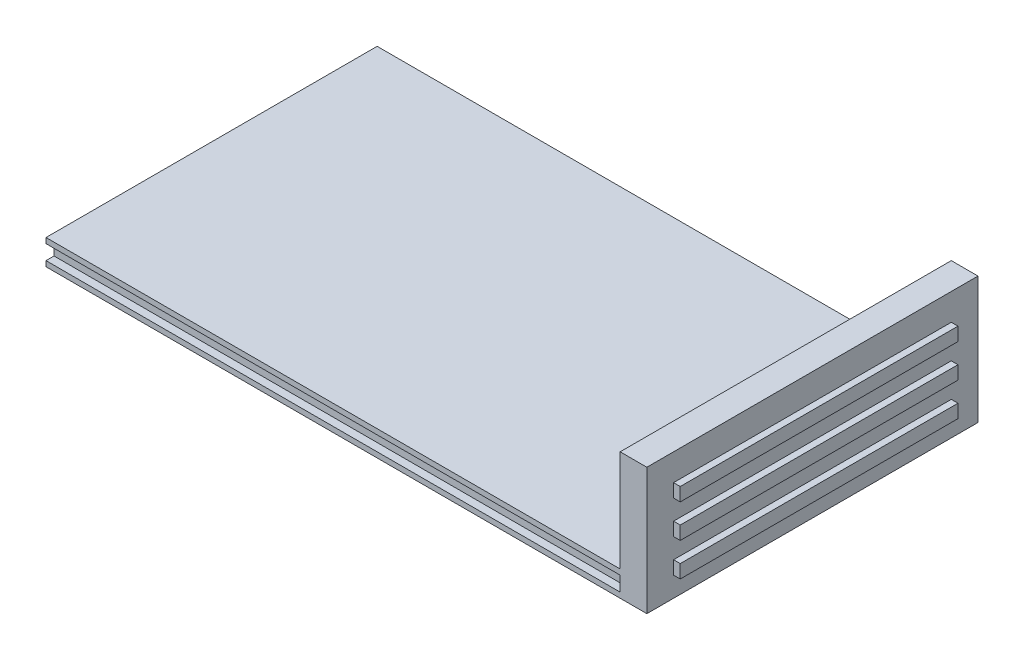
ISO-10303-21;
HEADER;
FILE_DESCRIPTION(('STEP AP214'),'2;1');
FILE_NAME('part.step','',(''),(''),'','','');
FILE_SCHEMA(('AUTOMOTIVE_DESIGN { 1 0 10303 214 1 1 1 1 }'));
ENDSEC;
DATA;
#1=APPLICATION_CONTEXT('core data for automotive mechanical design processes');
#2=APPLICATION_PROTOCOL_DEFINITION('international standard','automotive_design',2000,#1);
#3=PRODUCT_CONTEXT('',#1,'mechanical');
#4=PRODUCT('Part','Part','',(#3));
#5=PRODUCT_RELATED_PRODUCT_CATEGORY('part','',(#4));
#6=PRODUCT_DEFINITION_FORMATION('','',#4);
#7=PRODUCT_DEFINITION_CONTEXT('part definition',#1,'design');
#8=PRODUCT_DEFINITION('design','',#6,#7);
#9=PRODUCT_DEFINITION_SHAPE('','',#8);
#10=(LENGTH_UNIT() NAMED_UNIT(*) SI_UNIT(.MILLI.,.METRE.));
#11=(NAMED_UNIT(*) PLANE_ANGLE_UNIT() SI_UNIT($,.RADIAN.));
#12=(NAMED_UNIT(*) SI_UNIT($,.STERADIAN.) SOLID_ANGLE_UNIT());
#13=UNCERTAINTY_MEASURE_WITH_UNIT(LENGTH_MEASURE(1.E-05),#10,'distance_accuracy_value','');
#14=(GEOMETRIC_REPRESENTATION_CONTEXT(3) GLOBAL_UNCERTAINTY_ASSIGNED_CONTEXT((#13)) GLOBAL_UNIT_ASSIGNED_CONTEXT((#10,
#11,#12)) REPRESENTATION_CONTEXT('',''));
#15=CARTESIAN_POINT('',(0.,0.,0.));
#16=DIRECTION('',(0.,0.,1.));
#17=DIRECTION('',(1.,0.,0.));
#18=AXIS2_PLACEMENT_3D('',#15,#16,#17);
#19=CARTESIAN_POINT('',(46.,-10.,0.));
#20=DIRECTION('',(1.,0.,0.));
#21=DIRECTION('',(0.,0.,-1.));
#22=AXIS2_PLACEMENT_3D('',#19,#20,#21);
#23=PLANE('',#22);
#24=DIRECTION('',(0.,-1.,0.));
#25=VECTOR('',#24,1.);
#26=CARTESIAN_POINT('',(46.,5.,20.8));
#27=LINE('',#26,#25);
#28=CARTESIAN_POINT('',(46.,5.,20.8));
#29=VERTEX_POINT('',#28);
#30=CARTESIAN_POINT('',(46.,3.,20.8));
#31=VERTEX_POINT('',#30);
#32=EDGE_CURVE('E456',#29,#31,#27,.T.);
#33=ORIENTED_EDGE('',*,*,#32,.T.);
#34=DIRECTION('',(0.,0.,-1.));
#35=VECTOR('',#34,1.);
#36=CARTESIAN_POINT('',(46.,3.,20.8));
#37=LINE('',#36,#35);
#38=CARTESIAN_POINT('',(46.,3.,-20.8));
#39=VERTEX_POINT('',#38);
#40=EDGE_CURVE('E466',#31,#39,#37,.T.);
#41=ORIENTED_EDGE('',*,*,#40,.T.);
#42=DIRECTION('',(0.,1.,0.));
#43=VECTOR('',#42,1.);
#44=CARTESIAN_POINT('',(46.,5.,-20.8));
#45=LINE('',#44,#43);
#46=CARTESIAN_POINT('',(46.,5.,-20.8));
#47=VERTEX_POINT('',#46);
#48=EDGE_CURVE('E47',#39,#47,#45,.T.);
#49=ORIENTED_EDGE('',*,*,#48,.T.);
#50=DIRECTION('',(0.,0.,1.));
#51=VECTOR('',#50,1.);
#52=CARTESIAN_POINT('',(46.,5.,20.8));
#53=LINE('',#52,#51);
#54=EDGE_CURVE('E11',#47,#29,#53,.T.);
#55=ORIENTED_EDGE('',*,*,#54,.T.);
#56=EDGE_LOOP('',(#33,#41,#49,#55));
#57=FACE_BOUND('',#56,.T.);
#58=ADVANCED_FACE('F39',(#57),#23,.T.);
#59=CARTESIAN_POINT('',(46.,5.,20.8));
#60=DIRECTION('',(0.,-1.,0.));
#61=DIRECTION('',(0.,0.,-1.));
#62=AXIS2_PLACEMENT_3D('',#59,#60,#61);
#63=PLANE('',#62);
#64=DIRECTION('',(0.,0.,1.));
#65=VECTOR('',#64,1.);
#66=CARTESIAN_POINT('',(45.,5.,20.8));
#67=LINE('',#66,#65);
#68=CARTESIAN_POINT('',(45.,5.,-20.8));
#69=VERTEX_POINT('',#68);
#70=CARTESIAN_POINT('',(45.,5.,20.8));
#71=VERTEX_POINT('',#70);
#72=EDGE_CURVE('E442',#69,#71,#67,.T.);
#73=ORIENTED_EDGE('',*,*,#72,.T.);
#74=DIRECTION('',(-1.,0.,0.));
#75=VECTOR('',#74,1.);
#76=CARTESIAN_POINT('',(46.,5.,20.8));
#77=LINE('',#76,#75);
#78=EDGE_CURVE('E460',#29,#71,#77,.T.);
#79=ORIENTED_EDGE('',*,*,#78,.F.);
#80=ORIENTED_EDGE('',*,*,#54,.F.);
#81=DIRECTION('',(-1.,0.,0.));
#82=VECTOR('',#81,1.);
#83=CARTESIAN_POINT('',(46.,5.,-20.8));
#84=LINE('',#83,#82);
#85=EDGE_CURVE('E54',#47,#69,#84,.T.);
#86=ORIENTED_EDGE('',*,*,#85,.T.);
#87=EDGE_LOOP('',(#73,#79,#80,#86));
#88=FACE_BOUND('',#87,.T.);
#89=ADVANCED_FACE('F475',(#88),#63,.F.);
#90=CARTESIAN_POINT('',(46.,5.,-20.8));
#91=DIRECTION('',(0.,0.,1.));
#92=DIRECTION('',(1.,0.,0.));
#93=AXIS2_PLACEMENT_3D('',#90,#91,#92);
#94=PLANE('',#93);
#95=DIRECTION('',(0.,1.,0.));
#96=VECTOR('',#95,1.);
#97=CARTESIAN_POINT('',(45.,5.,-20.8));
#98=LINE('',#97,#96);
#99=CARTESIAN_POINT('',(45.,3.,-20.8));
#100=VERTEX_POINT('',#99);
#101=EDGE_CURVE('E446',#100,#69,#98,.T.);
#102=ORIENTED_EDGE('',*,*,#101,.T.);
#103=ORIENTED_EDGE('',*,*,#85,.F.);
#104=ORIENTED_EDGE('',*,*,#48,.F.);
#105=DIRECTION('',(-1.,0.,0.));
#106=VECTOR('',#105,1.);
#107=CARTESIAN_POINT('',(46.,3.,-20.8));
#108=LINE('',#107,#106);
#109=EDGE_CURVE('E62',#39,#100,#108,.T.);
#110=ORIENTED_EDGE('',*,*,#109,.T.);
#111=EDGE_LOOP('',(#102,#103,#104,#110));
#112=FACE_BOUND('',#111,.T.);
#113=ADVANCED_FACE('F481',(#112),#94,.F.);
#114=CARTESIAN_POINT('',(46.,3.,20.8));
#115=DIRECTION('',(0.,1.,0.));
#116=DIRECTION('',(0.,0.,1.));
#117=AXIS2_PLACEMENT_3D('',#114,#115,#116);
#118=PLANE('',#117);
#119=DIRECTION('',(0.,0.,-1.));
#120=VECTOR('',#119,1.);
#121=CARTESIAN_POINT('',(45.,3.,20.8));
#122=LINE('',#121,#120);
#123=CARTESIAN_POINT('',(45.,3.,20.8));
#124=VERTEX_POINT('',#123);
#125=EDGE_CURVE('E449',#124,#100,#122,.T.);
#126=ORIENTED_EDGE('',*,*,#125,.T.);
#127=ORIENTED_EDGE('',*,*,#109,.F.);
#128=ORIENTED_EDGE('',*,*,#40,.F.);
#129=DIRECTION('',(-1.,0.,0.));
#130=VECTOR('',#129,1.);
#131=CARTESIAN_POINT('',(46.,3.,20.8));
#132=LINE('',#131,#130);
#133=EDGE_CURVE('E452',#31,#124,#132,.T.);
#134=ORIENTED_EDGE('',*,*,#133,.T.);
#135=EDGE_LOOP('',(#126,#127,#128,#134));
#136=FACE_BOUND('',#135,.T.);
#137=ADVANCED_FACE('F479',(#136),#118,.F.);
#138=CARTESIAN_POINT('',(46.,5.,20.8));
#139=DIRECTION('',(0.,0.,-1.));
#140=DIRECTION('',(0.,1.,0.));
#141=AXIS2_PLACEMENT_3D('',#138,#139,#140);
#142=PLANE('',#141);
#143=DIRECTION('',(0.,-1.,0.));
#144=VECTOR('',#143,1.);
#145=CARTESIAN_POINT('',(45.,5.,20.8));
#146=LINE('',#145,#144);
#147=EDGE_CURVE('E439',#71,#124,#146,.T.);
#148=ORIENTED_EDGE('',*,*,#147,.T.);
#149=ORIENTED_EDGE('',*,*,#133,.F.);
#150=ORIENTED_EDGE('',*,*,#32,.F.);
#151=ORIENTED_EDGE('',*,*,#78,.T.);
#152=EDGE_LOOP('',(#148,#149,#150,#151));
#153=FACE_BOUND('',#152,.T.);
#154=ADVANCED_FACE('F477',(#153),#142,.F.);
#155=CARTESIAN_POINT('',(45.,3.8,24.8));
#156=DIRECTION('',(-1.,0.,0.));
#157=DIRECTION('',(0.,0.,1.));
#158=AXIS2_PLACEMENT_3D('',#155,#156,#157);
#159=PLANE('',#158);
#160=DIRECTION('',(0.,-1.,0.));
#161=VECTOR('',#160,1.);
#162=CARTESIAN_POINT('',(45.,15.,20.8));
#163=LINE('',#162,#161);
#164=CARTESIAN_POINT('',(45.,15.,20.8));
#165=VERTEX_POINT('',#164);
#166=CARTESIAN_POINT('',(45.,13.,20.8));
#167=VERTEX_POINT('',#166);
#168=EDGE_CURVE('E248',#165,#167,#163,.T.);
#169=ORIENTED_EDGE('',*,*,#168,.F.);
#170=DIRECTION('',(0.,0.,1.));
#171=VECTOR('',#170,1.);
#172=CARTESIAN_POINT('',(45.,15.,20.8));
#173=LINE('',#172,#171);
#174=CARTESIAN_POINT('',(45.,15.,-20.8));
#175=VERTEX_POINT('',#174);
#176=EDGE_CURVE('E258',#175,#165,#173,.T.);
#177=ORIENTED_EDGE('',*,*,#176,.F.);
#178=DIRECTION('',(0.,1.,0.));
#179=VECTOR('',#178,1.);
#180=CARTESIAN_POINT('',(45.,15.,-20.8));
#181=LINE('',#180,#179);
#182=CARTESIAN_POINT('',(45.,13.,-20.8));
#183=VERTEX_POINT('',#182);
#184=EDGE_CURVE('E275',#183,#175,#181,.T.);
#185=ORIENTED_EDGE('',*,*,#184,.F.);
#186=DIRECTION('',(0.,0.,-1.));
#187=VECTOR('',#186,1.);
#188=CARTESIAN_POINT('',(45.,13.,20.8));
#189=LINE('',#188,#187);
#190=EDGE_CURVE('E271',#167,#183,#189,.T.);
#191=ORIENTED_EDGE('',*,*,#190,.F.);
#192=EDGE_LOOP('',(#169,#177,#185,#191));
#193=FACE_BOUND('',#192,.T.);
#194=DIRECTION('',(0.,-1.,0.));
#195=VECTOR('',#194,1.);
#196=CARTESIAN_POINT('',(45.,3.8,24.8));
#197=LINE('',#196,#195);
#198=CARTESIAN_POINT('',(45.,19.,24.8));
#199=VERTEX_POINT('',#198);
#200=CARTESIAN_POINT('',(45.,0.,24.8));
#201=VERTEX_POINT('',#200);
#202=EDGE_CURVE('E406',#199,#201,#197,.T.);
#203=ORIENTED_EDGE('',*,*,#202,.T.);
#204=DIRECTION('',(0.,0.,-1.));
#205=VECTOR('',#204,1.);
#206=CARTESIAN_POINT('',(45.,0.,24.8));
#207=LINE('',#206,#205);
#208=CARTESIAN_POINT('',(45.,0.,-24.8));
#209=VERTEX_POINT('',#208);
#210=EDGE_CURVE('E385',#201,#209,#207,.T.);
#211=ORIENTED_EDGE('',*,*,#210,.T.);
#212=DIRECTION('',(0.,-1.,0.));
#213=VECTOR('',#212,1.);
#214=CARTESIAN_POINT('',(45.,3.8,-24.8));
#215=LINE('',#214,#213);
#216=CARTESIAN_POINT('',(45.,19.,-24.8));
#217=VERTEX_POINT('',#216);
#218=EDGE_CURVE('E432',#217,#209,#215,.T.);
#219=ORIENTED_EDGE('',*,*,#218,.F.);
#220=DIRECTION('',(0.,0.,1.));
#221=VECTOR('',#220,1.);
#222=CARTESIAN_POINT('',(45.,19.,24.8));
#223=LINE('',#222,#221);
#224=EDGE_CURVE('E297',#217,#199,#223,.T.);
#225=ORIENTED_EDGE('',*,*,#224,.T.);
#226=EDGE_LOOP('',(#203,#211,#219,#225));
#227=FACE_BOUND('',#226,.T.);
#228=DIRECTION('',(0.,-1.,0.));
#229=VECTOR('',#228,1.);
#230=CARTESIAN_POINT('',(45.,10.,20.8));
#231=LINE('',#230,#229);
#232=CARTESIAN_POINT('',(45.,10.,20.8));
#233=VERTEX_POINT('',#232);
#234=CARTESIAN_POINT('',(45.,8.,20.8));
#235=VERTEX_POINT('',#234);
#236=EDGE_CURVE('E242',#233,#235,#231,.T.);
#237=ORIENTED_EDGE('',*,*,#236,.F.);
#238=DIRECTION('',(0.,0.,1.));
#239=VECTOR('',#238,1.);
#240=CARTESIAN_POINT('',(45.,10.,20.8));
#241=LINE('',#240,#239);
#242=CARTESIAN_POINT('',(45.,10.,-20.8));
#243=VERTEX_POINT('',#242);
#244=EDGE_CURVE('E227',#243,#233,#241,.T.);
#245=ORIENTED_EDGE('',*,*,#244,.F.);
#246=DIRECTION('',(0.,1.,0.));
#247=VECTOR('',#246,1.);
#248=CARTESIAN_POINT('',(45.,10.,-20.8));
#249=LINE('',#248,#247);
#250=CARTESIAN_POINT('',(45.,8.,-20.8));
#251=VERTEX_POINT('',#250);
#252=EDGE_CURVE('E831',#251,#243,#249,.T.);
#253=ORIENTED_EDGE('',*,*,#252,.F.);
#254=DIRECTION('',(0.,0.,-1.));
#255=VECTOR('',#254,1.);
#256=CARTESIAN_POINT('',(45.,8.,20.8));
#257=LINE('',#256,#255);
#258=EDGE_CURVE('E244',#235,#251,#257,.T.);
#259=ORIENTED_EDGE('',*,*,#258,.F.);
#260=EDGE_LOOP('',(#237,#245,#253,#259));
#261=FACE_BOUND('',#260,.T.);
#262=ORIENTED_EDGE('',*,*,#147,.F.);
#263=ORIENTED_EDGE('',*,*,#72,.F.);
#264=ORIENTED_EDGE('',*,*,#101,.F.);
#265=ORIENTED_EDGE('',*,*,#125,.F.);
#266=EDGE_LOOP('',(#262,#263,#264,#265));
#267=FACE_BOUND('',#266,.T.);
#268=ADVANCED_FACE('F482',(#193,#227,#261,#267),#159,.F.);
#269=CARTESIAN_POINT('',(-45.,3.8,-24.8));
#270=DIRECTION('',(0.,0.,1.));
#271=DIRECTION('',(1.,0.,0.));
#272=AXIS2_PLACEMENT_3D('',#269,#270,#271);
#273=PLANE('',#272);
#274=DIRECTION('',(-1.,0.,0.));
#275=VECTOR('',#274,1.);
#276=CARTESIAN_POINT('',(-45.,3.8,-24.8));
#277=LINE('',#276,#275);
#278=CARTESIAN_POINT('',(41.,3.8,-24.8));
#279=VERTEX_POINT('',#278);
#280=CARTESIAN_POINT('',(-45.,3.8,-24.8));
#281=VERTEX_POINT('',#280);
#282=EDGE_CURVE('E396',#279,#281,#277,.T.);
#283=ORIENTED_EDGE('',*,*,#282,.F.);
#284=DIRECTION('',(0.,-1.,0.));
#285=VECTOR('',#284,1.);
#286=CARTESIAN_POINT('',(41.,19.,-24.8));
#287=LINE('',#286,#285);
#288=CARTESIAN_POINT('',(41.,19.,-24.8));
#289=VERTEX_POINT('',#288);
#290=EDGE_CURVE('E314',#289,#279,#287,.T.);
#291=ORIENTED_EDGE('',*,*,#290,.F.);
#292=DIRECTION('',(1.,0.,0.));
#293=VECTOR('',#292,1.);
#294=CARTESIAN_POINT('',(45.,19.,-24.8));
#295=LINE('',#294,#293);
#296=EDGE_CURVE('E309',#289,#217,#295,.T.);
#297=ORIENTED_EDGE('',*,*,#296,.T.);
#298=ORIENTED_EDGE('',*,*,#218,.T.);
#299=DIRECTION('',(-1.,0.,0.));
#300=VECTOR('',#299,1.);
#301=CARTESIAN_POINT('',(-45.,0.,-24.8));
#302=LINE('',#301,#300);
#303=CARTESIAN_POINT('',(-45.,0.,-24.8));
#304=VERTEX_POINT('',#303);
#305=EDGE_CURVE('E410',#209,#304,#302,.T.);
#306=ORIENTED_EDGE('',*,*,#305,.T.);
#307=DIRECTION('',(0.,-1.,0.));
#308=VECTOR('',#307,1.);
#309=CARTESIAN_POINT('',(-45.,3.8,-24.8));
#310=LINE('',#309,#308);
#311=CARTESIAN_POINT('',(-45.,0.8,-24.8));
#312=VERTEX_POINT('',#311);
#313=EDGE_CURVE('E427',#312,#304,#310,.T.);
#314=ORIENTED_EDGE('',*,*,#313,.F.);
#315=DIRECTION('',(1.,0.,0.));
#316=VECTOR('',#315,1.);
#317=CARTESIAN_POINT('',(-45.,0.8,-24.8));
#318=LINE('',#317,#316);
#319=CARTESIAN_POINT('',(41.,0.8,-24.8));
#320=VERTEX_POINT('',#319);
#321=EDGE_CURVE('E354',#312,#320,#318,.T.);
#322=ORIENTED_EDGE('',*,*,#321,.T.);
#323=CARTESIAN_POINT('',(41.,3.,-24.8));
#324=VERTEX_POINT('',#323);
#325=EDGE_CURVE('E319',#324,#320,#287,.T.);
#326=ORIENTED_EDGE('',*,*,#325,.F.);
#327=DIRECTION('',(1.,0.,0.));
#328=VECTOR('',#327,1.);
#329=CARTESIAN_POINT('',(-45.,3.,-24.8));
#330=LINE('',#329,#328);
#331=CARTESIAN_POINT('',(-45.,3.,-24.8));
#332=VERTEX_POINT('',#331);
#333=EDGE_CURVE('E353',#332,#324,#330,.T.);
#334=ORIENTED_EDGE('',*,*,#333,.F.);
#335=EDGE_CURVE('E428',#281,#332,#310,.T.);
#336=ORIENTED_EDGE('',*,*,#335,.F.);
#337=EDGE_LOOP('',(#283,#291,#297,#298,#306,#314,#322,#326,#334,#336));
#338=FACE_BOUND('',#337,.T.);
#339=ADVANCED_FACE('F484',(#338),#273,.F.);
#340=CARTESIAN_POINT('',(-45.,3.8,24.8));
#341=DIRECTION('',(1.,0.,0.));
#342=DIRECTION('',(0.,0.,-1.));
#343=AXIS2_PLACEMENT_3D('',#340,#341,#342);
#344=PLANE('',#343);
#345=DIRECTION('',(0.,0.,1.));
#346=VECTOR('',#345,1.);
#347=CARTESIAN_POINT('',(-45.,0.8,-24.8));
#348=LINE('',#347,#346);
#349=CARTESIAN_POINT('',(-45.,0.8,-23.6));
#350=VERTEX_POINT('',#349);
#351=EDGE_CURVE('E350',#312,#350,#348,.T.);
#352=ORIENTED_EDGE('',*,*,#351,.F.);
#353=ORIENTED_EDGE('',*,*,#313,.T.);
#354=DIRECTION('',(0.,0.,1.));
#355=VECTOR('',#354,1.);
#356=CARTESIAN_POINT('',(-45.,0.,24.8));
#357=LINE('',#356,#355);
#358=CARTESIAN_POINT('',(-45.,0.,24.8));
#359=VERTEX_POINT('',#358);
#360=EDGE_CURVE('E413',#304,#359,#357,.T.);
#361=ORIENTED_EDGE('',*,*,#360,.T.);
#362=DIRECTION('',(0.,-1.,0.));
#363=VECTOR('',#362,1.);
#364=CARTESIAN_POINT('',(-45.,3.8,24.8));
#365=LINE('',#364,#363);
#366=CARTESIAN_POINT('',(-45.,0.800000000000001,24.8));
#367=VERTEX_POINT('',#366);
#368=EDGE_CURVE('E422',#367,#359,#365,.T.);
#369=ORIENTED_EDGE('',*,*,#368,.F.);
#370=DIRECTION('',(0.,0.,-1.));
#371=VECTOR('',#370,1.);
#372=CARTESIAN_POINT('',(-45.,0.8,24.8));
#373=LINE('',#372,#371);
#374=CARTESIAN_POINT('',(-45.,0.8,23.6));
#375=VERTEX_POINT('',#374);
#376=EDGE_CURVE('E358',#367,#375,#373,.T.);
#377=ORIENTED_EDGE('',*,*,#376,.T.);
#378=DIRECTION('',(0.,1.,0.));
#379=VECTOR('',#378,1.);
#380=CARTESIAN_POINT('',(-45.,3.,23.6));
#381=LINE('',#380,#379);
#382=CARTESIAN_POINT('',(-45.,3.,23.6));
#383=VERTEX_POINT('',#382);
#384=EDGE_CURVE('E372',#375,#383,#381,.T.);
#385=ORIENTED_EDGE('',*,*,#384,.T.);
#386=DIRECTION('',(0.,0.,1.));
#387=VECTOR('',#386,1.);
#388=CARTESIAN_POINT('',(-45.,3.,24.8));
#389=LINE('',#388,#387);
#390=CARTESIAN_POINT('',(-45.,3.,24.8));
#391=VERTEX_POINT('',#390);
#392=EDGE_CURVE('E376',#383,#391,#389,.T.);
#393=ORIENTED_EDGE('',*,*,#392,.T.);
#394=CARTESIAN_POINT('',(-45.,3.8,24.8));
#395=VERTEX_POINT('',#394);
#396=EDGE_CURVE('E423',#395,#391,#365,.T.);
#397=ORIENTED_EDGE('',*,*,#396,.F.);
#398=DIRECTION('',(0.,0.,1.));
#399=VECTOR('',#398,1.);
#400=CARTESIAN_POINT('',(-45.,3.8,24.8));
#401=LINE('',#400,#399);
#402=EDGE_CURVE('E399',#281,#395,#401,.T.);
#403=ORIENTED_EDGE('',*,*,#402,.F.);
#404=ORIENTED_EDGE('',*,*,#335,.T.);
#405=DIRECTION('',(0.,0.,-1.));
#406=VECTOR('',#405,1.);
#407=CARTESIAN_POINT('',(-45.,3.,-24.8));
#408=LINE('',#407,#406);
#409=CARTESIAN_POINT('',(-45.,3.,-23.6));
#410=VERTEX_POINT('',#409);
#411=EDGE_CURVE('E343',#410,#332,#408,.T.);
#412=ORIENTED_EDGE('',*,*,#411,.F.);
#413=DIRECTION('',(0.,1.,0.));
#414=VECTOR('',#413,1.);
#415=CARTESIAN_POINT('',(-45.,3.,-23.6));
#416=LINE('',#415,#414);
#417=EDGE_CURVE('E346',#350,#410,#416,.T.);
#418=ORIENTED_EDGE('',*,*,#417,.F.);
#419=EDGE_LOOP('',(#352,#353,#361,#369,#377,#385,#393,#397,#403,#404,#412,#418));
#420=FACE_BOUND('',#419,.T.);
#421=ADVANCED_FACE('F491',(#420),#344,.F.);
#422=CARTESIAN_POINT('',(-45.,3.8,24.8));
#423=DIRECTION('',(0.,0.,-1.));
#424=DIRECTION('',(-1.,0.,0.));
#425=AXIS2_PLACEMENT_3D('',#422,#423,#424);
#426=PLANE('',#425);
#427=DIRECTION('',(1.,0.,0.));
#428=VECTOR('',#427,1.);
#429=CARTESIAN_POINT('',(-45.,0.,24.8));
#430=LINE('',#429,#428);
#431=EDGE_CURVE('E400',#359,#201,#430,.T.);
#432=ORIENTED_EDGE('',*,*,#431,.T.);
#433=ORIENTED_EDGE('',*,*,#202,.F.);
#434=DIRECTION('',(-1.,0.,0.));
#435=VECTOR('',#434,1.);
#436=CARTESIAN_POINT('',(45.,19.,24.8));
#437=LINE('',#436,#435);
#438=CARTESIAN_POINT('',(41.,19.,24.8));
#439=VERTEX_POINT('',#438);
#440=EDGE_CURVE('E301',#199,#439,#437,.T.);
#441=ORIENTED_EDGE('',*,*,#440,.T.);
#442=DIRECTION('',(0.,-1.,0.));
#443=VECTOR('',#442,1.);
#444=CARTESIAN_POINT('',(41.,19.,24.8));
#445=LINE('',#444,#443);
#446=CARTESIAN_POINT('',(41.,3.8,24.8));
#447=VERTEX_POINT('',#446);
#448=EDGE_CURVE('E320',#439,#447,#445,.T.);
#449=ORIENTED_EDGE('',*,*,#448,.T.);
#450=DIRECTION('',(1.,0.,0.));
#451=VECTOR('',#450,1.);
#452=CARTESIAN_POINT('',(-45.,3.8,24.8));
#453=LINE('',#452,#451);
#454=EDGE_CURVE('E403',#395,#447,#453,.T.);
#455=ORIENTED_EDGE('',*,*,#454,.F.);
#456=ORIENTED_EDGE('',*,*,#396,.T.);
#457=DIRECTION('',(1.,0.,0.));
#458=VECTOR('',#457,1.);
#459=CARTESIAN_POINT('',(-45.,3.,24.8));
#460=LINE('',#459,#458);
#461=CARTESIAN_POINT('',(41.,3.,24.8));
#462=VERTEX_POINT('',#461);
#463=EDGE_CURVE('E381',#391,#462,#460,.T.);
#464=ORIENTED_EDGE('',*,*,#463,.T.);
#465=CARTESIAN_POINT('',(41.,0.8,24.8));
#466=VERTEX_POINT('',#465);
#467=EDGE_CURVE('E313',#462,#466,#445,.T.);
#468=ORIENTED_EDGE('',*,*,#467,.T.);
#469=DIRECTION('',(1.,0.,0.));
#470=VECTOR('',#469,1.);
#471=CARTESIAN_POINT('',(-45.,0.8,24.8));
#472=LINE('',#471,#470);
#473=EDGE_CURVE('E380',#367,#466,#472,.T.);
#474=ORIENTED_EDGE('',*,*,#473,.F.);
#475=ORIENTED_EDGE('',*,*,#368,.T.);
#476=EDGE_LOOP('',(#432,#433,#441,#449,#455,#456,#464,#468,#474,#475));
#477=FACE_BOUND('',#476,.T.);
#478=ADVANCED_FACE('F628',(#477),#426,.F.);
#479=CARTESIAN_POINT('',(0.,3.8,0.));
#480=DIRECTION('',(0.,-1.,0.));
#481=DIRECTION('',(0.,0.,-1.));
#482=AXIS2_PLACEMENT_3D('',#479,#480,#481);
#483=PLANE('',#482);
#484=ORIENTED_EDGE('',*,*,#454,.T.);
#485=DIRECTION('',(0.,0.,-1.));
#486=VECTOR('',#485,1.);
#487=CARTESIAN_POINT('',(41.,3.8,0.));
#488=LINE('',#487,#486);
#489=EDGE_CURVE('E340',#447,#279,#488,.T.);
#490=ORIENTED_EDGE('',*,*,#489,.T.);
#491=ORIENTED_EDGE('',*,*,#282,.T.);
#492=ORIENTED_EDGE('',*,*,#402,.T.);
#493=EDGE_LOOP('',(#484,#490,#491,#492));
#494=FACE_BOUND('',#493,.T.);
#495=ADVANCED_FACE('F625',(#494),#483,.F.);
#496=CARTESIAN_POINT('',(0.,0.,0.));
#497=DIRECTION('',(0.,-1.,0.));
#498=DIRECTION('',(0.,0.,-1.));
#499=AXIS2_PLACEMENT_3D('',#496,#497,#498);
#500=PLANE('',#499);
#501=ORIENTED_EDGE('',*,*,#360,.F.);
#502=ORIENTED_EDGE('',*,*,#305,.F.);
#503=ORIENTED_EDGE('',*,*,#210,.F.);
#504=ORIENTED_EDGE('',*,*,#431,.F.);
#505=EDGE_LOOP('',(#501,#502,#503,#504));
#506=FACE_BOUND('',#505,.T.);
#507=ADVANCED_FACE('F617',(#506),#500,.T.);
#508=CARTESIAN_POINT('',(-45.,3.,24.8));
#509=DIRECTION('',(0.,1.,0.));
#510=DIRECTION('',(0.,0.,1.));
#511=AXIS2_PLACEMENT_3D('',#508,#509,#510);
#512=PLANE('',#511);
#513=DIRECTION('',(1.,0.,0.));
#514=VECTOR('',#513,1.);
#515=CARTESIAN_POINT('',(-45.,3.,23.6));
#516=LINE('',#515,#514);
#517=CARTESIAN_POINT('',(41.,3.,23.6));
#518=VERTEX_POINT('',#517);
#519=EDGE_CURVE('E386',#383,#518,#516,.T.);
#520=ORIENTED_EDGE('',*,*,#519,.T.);
#521=DIRECTION('',(0.,0.,1.));
#522=VECTOR('',#521,1.);
#523=CARTESIAN_POINT('',(41.,3.,24.8));
#524=LINE('',#523,#522);
#525=EDGE_CURVE('E337',#518,#462,#524,.T.);
#526=ORIENTED_EDGE('',*,*,#525,.T.);
#527=ORIENTED_EDGE('',*,*,#463,.F.);
#528=ORIENTED_EDGE('',*,*,#392,.F.);
#529=EDGE_LOOP('',(#520,#526,#527,#528));
#530=FACE_BOUND('',#529,.T.);
#531=ADVANCED_FACE('F613',(#530),#512,.F.);
#532=CARTESIAN_POINT('',(-45.,3.,23.6));
#533=DIRECTION('',(0.,0.,-1.));
#534=DIRECTION('',(-1.,0.,0.));
#535=AXIS2_PLACEMENT_3D('',#532,#533,#534);
#536=PLANE('',#535);
#537=DIRECTION('',(1.,0.,0.));
#538=VECTOR('',#537,1.);
#539=CARTESIAN_POINT('',(-45.,0.8,23.6));
#540=LINE('',#539,#538);
#541=CARTESIAN_POINT('',(41.,0.8,23.6));
#542=VERTEX_POINT('',#541);
#543=EDGE_CURVE('E390',#375,#542,#540,.T.);
#544=ORIENTED_EDGE('',*,*,#543,.T.);
#545=DIRECTION('',(0.,1.,0.));
#546=VECTOR('',#545,1.);
#547=CARTESIAN_POINT('',(41.,3.,23.6));
#548=LINE('',#547,#546);
#549=EDGE_CURVE('E334',#542,#518,#548,.T.);
#550=ORIENTED_EDGE('',*,*,#549,.T.);
#551=ORIENTED_EDGE('',*,*,#519,.F.);
#552=ORIENTED_EDGE('',*,*,#384,.F.);
#553=EDGE_LOOP('',(#544,#550,#551,#552));
#554=FACE_BOUND('',#553,.T.);
#555=ADVANCED_FACE('F616',(#554),#536,.F.);
#556=CARTESIAN_POINT('',(-45.,0.8,24.8));
#557=DIRECTION('',(0.,-1.,0.));
#558=DIRECTION('',(0.,0.,-1.));
#559=AXIS2_PLACEMENT_3D('',#556,#557,#558);
#560=PLANE('',#559);
#561=ORIENTED_EDGE('',*,*,#473,.T.);
#562=DIRECTION('',(0.,0.,-1.));
#563=VECTOR('',#562,1.);
#564=CARTESIAN_POINT('',(41.,0.8,24.8));
#565=LINE('',#564,#563);
#566=EDGE_CURVE('E331',#466,#542,#565,.T.);
#567=ORIENTED_EDGE('',*,*,#566,.T.);
#568=ORIENTED_EDGE('',*,*,#543,.F.);
#569=ORIENTED_EDGE('',*,*,#376,.F.);
#570=EDGE_LOOP('',(#561,#567,#568,#569));
#571=FACE_BOUND('',#570,.T.);
#572=ADVANCED_FACE('F605',(#571),#560,.F.);
#573=CARTESIAN_POINT('',(-45.,0.8,-24.8));
#574=DIRECTION('',(0.,1.,0.));
#575=DIRECTION('',(0.,0.,1.));
#576=AXIS2_PLACEMENT_3D('',#573,#574,#575);
#577=PLANE('',#576);
#578=DIRECTION('',(0.,0.,1.));
#579=VECTOR('',#578,1.);
#580=CARTESIAN_POINT('',(41.,0.8,-24.8));
#581=LINE('',#580,#579);
#582=CARTESIAN_POINT('',(41.,0.8,-23.6));
#583=VERTEX_POINT('',#582);
#584=EDGE_CURVE('E327',#320,#583,#581,.T.);
#585=ORIENTED_EDGE('',*,*,#584,.F.);
#586=ORIENTED_EDGE('',*,*,#321,.F.);
#587=ORIENTED_EDGE('',*,*,#351,.T.);
#588=DIRECTION('',(1.,0.,0.));
#589=VECTOR('',#588,1.);
#590=CARTESIAN_POINT('',(-45.,0.8,-23.6));
#591=LINE('',#590,#589);
#592=EDGE_CURVE('E359',#350,#583,#591,.T.);
#593=ORIENTED_EDGE('',*,*,#592,.T.);
#594=EDGE_LOOP('',(#585,#586,#587,#593));
#595=FACE_BOUND('',#594,.T.);
#596=ADVANCED_FACE('F601',(#595),#577,.T.);
#597=CARTESIAN_POINT('',(-45.,3.,-23.6));
#598=DIRECTION('',(0.,0.,-1.));
#599=DIRECTION('',(-1.,0.,0.));
#600=AXIS2_PLACEMENT_3D('',#597,#598,#599);
#601=PLANE('',#600);
#602=DIRECTION('',(0.,1.,0.));
#603=VECTOR('',#602,1.);
#604=CARTESIAN_POINT('',(41.,3.,-23.6));
#605=LINE('',#604,#603);
#606=CARTESIAN_POINT('',(41.,3.,-23.6));
#607=VERTEX_POINT('',#606);
#608=EDGE_CURVE('E318',#583,#607,#605,.T.);
#609=ORIENTED_EDGE('',*,*,#608,.F.);
#610=ORIENTED_EDGE('',*,*,#592,.F.);
#611=ORIENTED_EDGE('',*,*,#417,.T.);
#612=DIRECTION('',(1.,0.,0.));
#613=VECTOR('',#612,1.);
#614=CARTESIAN_POINT('',(-45.,3.,-23.6));
#615=LINE('',#614,#613);
#616=EDGE_CURVE('E363',#410,#607,#615,.T.);
#617=ORIENTED_EDGE('',*,*,#616,.T.);
#618=EDGE_LOOP('',(#609,#610,#611,#617));
#619=FACE_BOUND('',#618,.T.);
#620=ADVANCED_FACE('F604',(#619),#601,.T.);
#621=CARTESIAN_POINT('',(-45.,3.,-24.8));
#622=DIRECTION('',(0.,-1.,0.));
#623=DIRECTION('',(0.,0.,-1.));
#624=AXIS2_PLACEMENT_3D('',#621,#622,#623);
#625=PLANE('',#624);
#626=DIRECTION('',(0.,0.,-1.));
#627=VECTOR('',#626,1.);
#628=CARTESIAN_POINT('',(41.,3.,-24.8));
#629=LINE('',#628,#627);
#630=EDGE_CURVE('E435',#607,#324,#629,.T.);
#631=ORIENTED_EDGE('',*,*,#630,.F.);
#632=ORIENTED_EDGE('',*,*,#616,.F.);
#633=ORIENTED_EDGE('',*,*,#411,.T.);
#634=ORIENTED_EDGE('',*,*,#333,.T.);
#635=EDGE_LOOP('',(#631,#632,#633,#634));
#636=FACE_BOUND('',#635,.T.);
#637=ADVANCED_FACE('F599',(#636),#625,.T.);
#638=CARTESIAN_POINT('',(41.,19.,24.8));
#639=DIRECTION('',(-1.,0.,0.));
#640=DIRECTION('',(0.,0.,1.));
#641=AXIS2_PLACEMENT_3D('',#638,#639,#640);
#642=PLANE('',#641);
#643=ORIENTED_EDGE('',*,*,#325,.T.);
#644=ORIENTED_EDGE('',*,*,#584,.T.);
#645=ORIENTED_EDGE('',*,*,#608,.T.);
#646=ORIENTED_EDGE('',*,*,#630,.T.);
#647=EDGE_LOOP('',(#643,#644,#645,#646));
#648=FACE_BOUND('',#647,.T.);
#649=ADVANCED_FACE('F595',(#648),#642,.T.);
#650=ORIENTED_EDGE('',*,*,#525,.F.);
#651=ORIENTED_EDGE('',*,*,#549,.F.);
#652=ORIENTED_EDGE('',*,*,#566,.F.);
#653=ORIENTED_EDGE('',*,*,#467,.F.);
#654=EDGE_LOOP('',(#650,#651,#652,#653));
#655=FACE_BOUND('',#654,.T.);
#656=ADVANCED_FACE('F598',(#655),#642,.T.);
#657=ORIENTED_EDGE('',*,*,#489,.F.);
#658=ORIENTED_EDGE('',*,*,#448,.F.);
#659=DIRECTION('',(0.,0.,-1.));
#660=VECTOR('',#659,1.);
#661=CARTESIAN_POINT('',(41.,19.,24.8));
#662=LINE('',#661,#660);
#663=EDGE_CURVE('E305',#439,#289,#662,.T.);
#664=ORIENTED_EDGE('',*,*,#663,.T.);
#665=ORIENTED_EDGE('',*,*,#290,.T.);
#666=EDGE_LOOP('',(#657,#658,#664,#665));
#667=FACE_BOUND('',#666,.T.);
#668=ADVANCED_FACE('F593',(#667),#642,.T.);
#669=CARTESIAN_POINT('',(0.,19.,0.));
#670=DIRECTION('',(0.,1.,0.));
#671=DIRECTION('',(0.,0.,1.));
#672=AXIS2_PLACEMENT_3D('',#669,#670,#671);
#673=PLANE('',#672);
#674=ORIENTED_EDGE('',*,*,#224,.F.);
#675=ORIENTED_EDGE('',*,*,#296,.F.);
#676=ORIENTED_EDGE('',*,*,#663,.F.);
#677=ORIENTED_EDGE('',*,*,#440,.F.);
#678=EDGE_LOOP('',(#674,#675,#676,#677));
#679=FACE_BOUND('',#678,.T.);
#680=ADVANCED_FACE('F589',(#679),#673,.T.);
#681=CARTESIAN_POINT('',(46.,15.,20.8));
#682=DIRECTION('',(0.,0.,-1.));
#683=DIRECTION('',(0.,1.,0.));
#684=AXIS2_PLACEMENT_3D('',#681,#682,#683);
#685=PLANE('',#684);
#686=ORIENTED_EDGE('',*,*,#168,.T.);
#687=DIRECTION('',(-1.,0.,0.));
#688=VECTOR('',#687,1.);
#689=CARTESIAN_POINT('',(46.,13.,20.8));
#690=LINE('',#689,#688);
#691=CARTESIAN_POINT('',(46.,13.,20.8));
#692=VERTEX_POINT('',#691);
#693=EDGE_CURVE('E293',#692,#167,#690,.T.);
#694=ORIENTED_EDGE('',*,*,#693,.F.);
#695=DIRECTION('',(0.,-1.,0.));
#696=VECTOR('',#695,1.);
#697=CARTESIAN_POINT('',(46.,15.,20.8));
#698=LINE('',#697,#696);
#699=CARTESIAN_POINT('',(46.,15.,20.8));
#700=VERTEX_POINT('',#699);
#701=EDGE_CURVE('E253',#700,#692,#698,.T.);
#702=ORIENTED_EDGE('',*,*,#701,.F.);
#703=DIRECTION('',(-1.,0.,0.));
#704=VECTOR('',#703,1.);
#705=CARTESIAN_POINT('',(46.,15.,20.8));
#706=LINE('',#705,#704);
#707=EDGE_CURVE('E267',#700,#165,#706,.T.);
#708=ORIENTED_EDGE('',*,*,#707,.T.);
#709=EDGE_LOOP('',(#686,#694,#702,#708));
#710=FACE_BOUND('',#709,.T.);
#711=ADVANCED_FACE('F585',(#710),#685,.F.);
#712=CARTESIAN_POINT('',(46.,13.,20.8));
#713=DIRECTION('',(0.,1.,0.));
#714=DIRECTION('',(0.,0.,1.));
#715=AXIS2_PLACEMENT_3D('',#712,#713,#714);
#716=PLANE('',#715);
#717=ORIENTED_EDGE('',*,*,#190,.T.);
#718=DIRECTION('',(-1.,0.,0.));
#719=VECTOR('',#718,1.);
#720=CARTESIAN_POINT('',(46.,13.,-20.8));
#721=LINE('',#720,#719);
#722=CARTESIAN_POINT('',(46.,13.,-20.8));
#723=VERTEX_POINT('',#722);
#724=EDGE_CURVE('E289',#723,#183,#721,.T.);
#725=ORIENTED_EDGE('',*,*,#724,.F.);
#726=DIRECTION('',(0.,0.,-1.));
#727=VECTOR('',#726,1.);
#728=CARTESIAN_POINT('',(46.,13.,20.8));
#729=LINE('',#728,#727);
#730=EDGE_CURVE('E257',#692,#723,#729,.T.);
#731=ORIENTED_EDGE('',*,*,#730,.F.);
#732=ORIENTED_EDGE('',*,*,#693,.T.);
#733=EDGE_LOOP('',(#717,#725,#731,#732));
#734=FACE_BOUND('',#733,.T.);
#735=ADVANCED_FACE('F581',(#734),#716,.F.);
#736=CARTESIAN_POINT('',(46.,15.,-20.8));
#737=DIRECTION('',(0.,0.,1.));
#738=DIRECTION('',(1.,0.,0.));
#739=AXIS2_PLACEMENT_3D('',#736,#737,#738);
#740=PLANE('',#739);
#741=ORIENTED_EDGE('',*,*,#184,.T.);
#742=DIRECTION('',(-1.,0.,0.));
#743=VECTOR('',#742,1.);
#744=CARTESIAN_POINT('',(46.,15.,-20.8));
#745=LINE('',#744,#743);
#746=CARTESIAN_POINT('',(46.,15.,-20.8));
#747=VERTEX_POINT('',#746);
#748=EDGE_CURVE('E285',#747,#175,#745,.T.);
#749=ORIENTED_EDGE('',*,*,#748,.F.);
#750=DIRECTION('',(0.,1.,0.));
#751=VECTOR('',#750,1.);
#752=CARTESIAN_POINT('',(46.,15.,-20.8));
#753=LINE('',#752,#751);
#754=EDGE_CURVE('E261',#723,#747,#753,.T.);
#755=ORIENTED_EDGE('',*,*,#754,.F.);
#756=ORIENTED_EDGE('',*,*,#724,.T.);
#757=EDGE_LOOP('',(#741,#749,#755,#756));
#758=FACE_BOUND('',#757,.T.);
#759=ADVANCED_FACE('F577',(#758),#740,.F.);
#760=CARTESIAN_POINT('',(46.,15.,20.8));
#761=DIRECTION('',(0.,-1.,0.));
#762=DIRECTION('',(0.,0.,-1.));
#763=AXIS2_PLACEMENT_3D('',#760,#761,#762);
#764=PLANE('',#763);
#765=ORIENTED_EDGE('',*,*,#176,.T.);
#766=ORIENTED_EDGE('',*,*,#707,.F.);
#767=DIRECTION('',(0.,0.,1.));
#768=VECTOR('',#767,1.);
#769=CARTESIAN_POINT('',(46.,15.,20.8));
#770=LINE('',#769,#768);
#771=EDGE_CURVE('E264',#747,#700,#770,.T.);
#772=ORIENTED_EDGE('',*,*,#771,.F.);
#773=ORIENTED_EDGE('',*,*,#748,.T.);
#774=EDGE_LOOP('',(#765,#766,#772,#773));
#775=FACE_BOUND('',#774,.T.);
#776=ADVANCED_FACE('F573',(#775),#764,.F.);
#777=CARTESIAN_POINT('',(46.,0.,0.));
#778=DIRECTION('',(1.,0.,0.));
#779=DIRECTION('',(0.,0.,-1.));
#780=AXIS2_PLACEMENT_3D('',#777,#778,#779);
#781=PLANE('',#780);
#782=ORIENTED_EDGE('',*,*,#701,.T.);
#783=ORIENTED_EDGE('',*,*,#730,.T.);
#784=ORIENTED_EDGE('',*,*,#754,.T.);
#785=ORIENTED_EDGE('',*,*,#771,.T.);
#786=EDGE_LOOP('',(#782,#783,#784,#785));
#787=FACE_BOUND('',#786,.T.);
#788=ADVANCED_FACE('F530',(#787),#781,.T.);
#789=CARTESIAN_POINT('',(46.,10.,20.8));
#790=DIRECTION('',(0.,0.,-1.));
#791=DIRECTION('',(0.,1.,0.));
#792=AXIS2_PLACEMENT_3D('',#789,#790,#791);
#793=PLANE('',#792);
#794=ORIENTED_EDGE('',*,*,#236,.T.);
#795=DIRECTION('',(-1.,0.,0.));
#796=VECTOR('',#795,1.);
#797=CARTESIAN_POINT('',(46.,8.,20.8));
#798=LINE('',#797,#796);
#799=CARTESIAN_POINT('',(46.,8.,20.8));
#800=VERTEX_POINT('',#799);
#801=EDGE_CURVE('E234',#800,#235,#798,.T.);
#802=ORIENTED_EDGE('',*,*,#801,.F.);
#803=DIRECTION('',(0.,-1.,0.));
#804=VECTOR('',#803,1.);
#805=CARTESIAN_POINT('',(46.,10.,20.8));
#806=LINE('',#805,#804);
#807=CARTESIAN_POINT('',(46.,10.,20.8));
#808=VERTEX_POINT('',#807);
#809=EDGE_CURVE('E215',#808,#800,#806,.T.);
#810=ORIENTED_EDGE('',*,*,#809,.F.);
#811=DIRECTION('',(-1.,0.,0.));
#812=VECTOR('',#811,1.);
#813=CARTESIAN_POINT('',(46.,10.,20.8));
#814=LINE('',#813,#812);
#815=EDGE_CURVE('E821',#808,#233,#814,.T.);
#816=ORIENTED_EDGE('',*,*,#815,.T.);
#817=EDGE_LOOP('',(#794,#802,#810,#816));
#818=FACE_BOUND('',#817,.T.);
#819=ADVANCED_FACE('F241',(#818),#793,.F.);
#820=CARTESIAN_POINT('',(46.,8.,20.8));
#821=DIRECTION('',(0.,1.,0.));
#822=DIRECTION('',(0.,0.,1.));
#823=AXIS2_PLACEMENT_3D('',#820,#821,#822);
#824=PLANE('',#823);
#825=ORIENTED_EDGE('',*,*,#258,.T.);
#826=DIRECTION('',(-1.,0.,0.));
#827=VECTOR('',#826,1.);
#828=CARTESIAN_POINT('',(46.,8.,-20.8));
#829=LINE('',#828,#827);
#830=CARTESIAN_POINT('',(46.,8.,-20.8));
#831=VERTEX_POINT('',#830);
#832=EDGE_CURVE('E237',#831,#251,#829,.T.);
#833=ORIENTED_EDGE('',*,*,#832,.F.);
#834=DIRECTION('',(0.,0.,-1.));
#835=VECTOR('',#834,1.);
#836=CARTESIAN_POINT('',(46.,8.,20.8));
#837=LINE('',#836,#835);
#838=EDGE_CURVE('E218',#800,#831,#837,.T.);
#839=ORIENTED_EDGE('',*,*,#838,.F.);
#840=ORIENTED_EDGE('',*,*,#801,.T.);
#841=EDGE_LOOP('',(#825,#833,#839,#840));
#842=FACE_BOUND('',#841,.T.);
#843=ADVANCED_FACE('F233',(#842),#824,.F.);
#844=CARTESIAN_POINT('',(46.,10.,-20.8));
#845=DIRECTION('',(0.,0.,1.));
#846=DIRECTION('',(1.,0.,0.));
#847=AXIS2_PLACEMENT_3D('',#844,#845,#846);
#848=PLANE('',#847);
#849=ORIENTED_EDGE('',*,*,#252,.T.);
#850=DIRECTION('',(-1.,0.,0.));
#851=VECTOR('',#850,1.);
#852=CARTESIAN_POINT('',(46.,10.,-20.8));
#853=LINE('',#852,#851);
#854=CARTESIAN_POINT('',(46.,10.,-20.8));
#855=VERTEX_POINT('',#854);
#856=EDGE_CURVE('E823',#855,#243,#853,.T.);
#857=ORIENTED_EDGE('',*,*,#856,.F.);
#858=DIRECTION('',(0.,1.,0.));
#859=VECTOR('',#858,1.);
#860=CARTESIAN_POINT('',(46.,10.,-20.8));
#861=LINE('',#860,#859);
#862=EDGE_CURVE('E239',#831,#855,#861,.T.);
#863=ORIENTED_EDGE('',*,*,#862,.F.);
#864=ORIENTED_EDGE('',*,*,#832,.T.);
#865=EDGE_LOOP('',(#849,#857,#863,#864));
#866=FACE_BOUND('',#865,.T.);
#867=ADVANCED_FACE('F540',(#866),#848,.F.);
#868=CARTESIAN_POINT('',(46.,10.,20.8));
#869=DIRECTION('',(0.,-1.,0.));
#870=DIRECTION('',(0.,0.,-1.));
#871=AXIS2_PLACEMENT_3D('',#868,#869,#870);
#872=PLANE('',#871);
#873=ORIENTED_EDGE('',*,*,#244,.T.);
#874=ORIENTED_EDGE('',*,*,#815,.F.);
#875=DIRECTION('',(0.,0.,1.));
#876=VECTOR('',#875,1.);
#877=CARTESIAN_POINT('',(46.,10.,20.8));
#878=LINE('',#877,#876);
#879=EDGE_CURVE('E221',#855,#808,#878,.T.);
#880=ORIENTED_EDGE('',*,*,#879,.F.);
#881=ORIENTED_EDGE('',*,*,#856,.T.);
#882=EDGE_LOOP('',(#873,#874,#880,#881));
#883=FACE_BOUND('',#882,.T.);
#884=ADVANCED_FACE('F549',(#883),#872,.F.);
#885=CARTESIAN_POINT('',(46.,-5.,0.));
#886=DIRECTION('',(1.,0.,0.));
#887=DIRECTION('',(0.,0.,-1.));
#888=AXIS2_PLACEMENT_3D('',#885,#886,#887);
#889=PLANE('',#888);
#890=ORIENTED_EDGE('',*,*,#809,.T.);
#891=ORIENTED_EDGE('',*,*,#838,.T.);
#892=ORIENTED_EDGE('',*,*,#862,.T.);
#893=ORIENTED_EDGE('',*,*,#879,.T.);
#894=EDGE_LOOP('',(#890,#891,#892,#893));
#895=FACE_BOUND('',#894,.T.);
#896=ADVANCED_FACE('F217',(#895),#889,.T.);
#897=CLOSED_SHELL('',(#58,#89,#113,#137,#154,#268,#339,#421,#478,#495,#507,#531,#555,#572,#596,
#620,#637,#649,#656,#668,#680,#711,#735,#759,#776,#788,#819,#843,#867,#884,#896));
#898=MANIFOLD_SOLID_BREP('B2',#897);
#899=ADVANCED_BREP_SHAPE_REPRESENTATION('',(#18,#898),#14);
#900=SHAPE_DEFINITION_REPRESENTATION(#9,#899);
ENDSEC;
END-ISO-10303-21;
